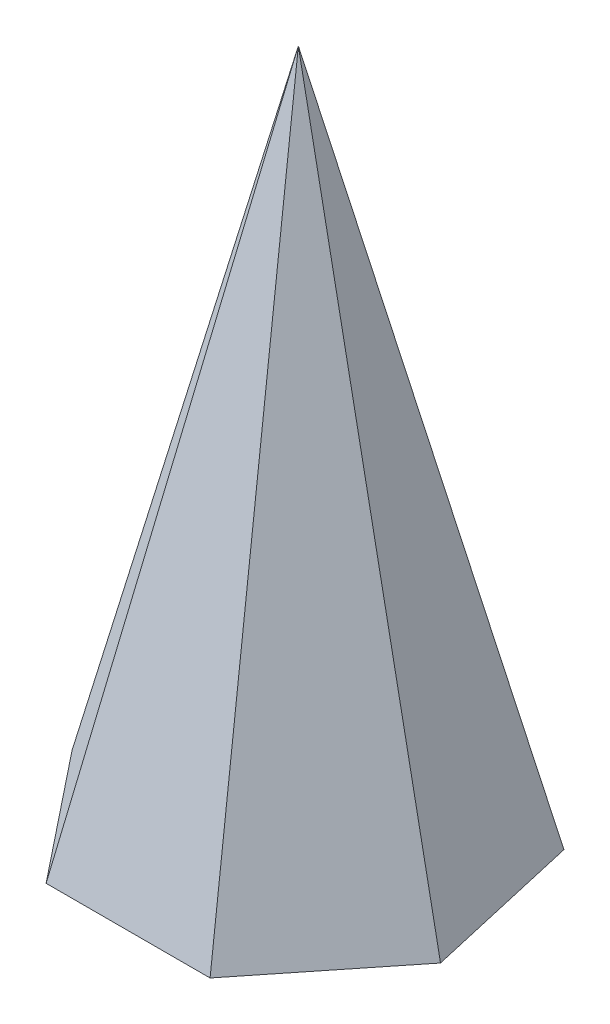
ISO-10303-21;
HEADER;
FILE_DESCRIPTION(('STEP AP214'),'2;1');
FILE_NAME('part.step','',(''),(''),'','','');
FILE_SCHEMA(('AUTOMOTIVE_DESIGN { 1 0 10303 214 1 1 1 1 }'));
ENDSEC;
DATA;
#1=APPLICATION_CONTEXT('core data for automotive mechanical design processes');
#2=APPLICATION_PROTOCOL_DEFINITION('international standard','automotive_design',2000,#1);
#3=PRODUCT_CONTEXT('',#1,'mechanical');
#4=PRODUCT('Part','Part','',(#3));
#5=PRODUCT_RELATED_PRODUCT_CATEGORY('part','',(#4));
#6=PRODUCT_DEFINITION_FORMATION('','',#4);
#7=PRODUCT_DEFINITION_CONTEXT('part definition',#1,'design');
#8=PRODUCT_DEFINITION('design','',#6,#7);
#9=PRODUCT_DEFINITION_SHAPE('','',#8);
#10=(LENGTH_UNIT() NAMED_UNIT(*) SI_UNIT(.MILLI.,.METRE.));
#11=(NAMED_UNIT(*) PLANE_ANGLE_UNIT() SI_UNIT($,.RADIAN.));
#12=(NAMED_UNIT(*) SI_UNIT($,.STERADIAN.) SOLID_ANGLE_UNIT());
#13=UNCERTAINTY_MEASURE_WITH_UNIT(LENGTH_MEASURE(1.E-05),#10,'distance_accuracy_value','');
#14=(GEOMETRIC_REPRESENTATION_CONTEXT(3) GLOBAL_UNCERTAINTY_ASSIGNED_CONTEXT((#13)) GLOBAL_UNIT_ASSIGNED_CONTEXT((#10,
#11,#12)) REPRESENTATION_CONTEXT('',''));
#15=CARTESIAN_POINT('',(0.,0.,0.));
#16=DIRECTION('',(0.,0.,1.));
#17=DIRECTION('',(1.,0.,0.));
#18=AXIS2_PLACEMENT_3D('',#15,#16,#17);
#19=CARTESIAN_POINT('',(0.,0.,8.01937735804838));
#20=DIRECTION('',(0.,-1.,0.));
#21=DIRECTION('',(0.,0.,-1.));
#22=AXIS2_PLACEMENT_3D('',#19,#20,#21);
#23=PLANE('',#22);
#24=DIRECTION('',(0.623489801858734,0.,-0.78183148246803));
#25=VECTOR('',#24,1.);
#26=CARTESIAN_POINT('',(2.40787309403764,0.,5.));
#27=LINE('',#26,#25);
#28=CARTESIAN_POINT('',(2.40787309403764,0.,5.));
#29=VERTEX_POINT('',#28);
#30=CARTESIAN_POINT('',(5.41044173064266,0.,1.23489801858734));
#31=VERTEX_POINT('',#30);
#32=EDGE_CURVE('E82',#29,#31,#27,.T.);
#33=ORIENTED_EDGE('',*,*,#32,.F.);
#34=DIRECTION('',(1.,0.,0.));
#35=VECTOR('',#34,1.);
#36=CARTESIAN_POINT('',(-2.40787309403764,0.,5.));
#37=LINE('',#36,#35);
#38=CARTESIAN_POINT('',(-2.40787309403764,0.,5.));
#39=VERTEX_POINT('',#38);
#40=EDGE_CURVE('E12',#39,#29,#37,.T.);
#41=ORIENTED_EDGE('',*,*,#40,.F.);
#42=DIRECTION('',(0.623489801858734,0.,0.78183148246803));
#43=VECTOR('',#42,1.);
#44=CARTESIAN_POINT('',(-5.41044173064266,0.,1.23489801858734));
#45=LINE('',#44,#43);
#46=CARTESIAN_POINT('',(-5.41044173064266,0.,1.23489801858734));
#47=VERTEX_POINT('',#46);
#48=EDGE_CURVE('E47',#47,#39,#45,.T.);
#49=ORIENTED_EDGE('',*,*,#48,.F.);
#50=DIRECTION('',(-0.222520933956314,0.,0.974927912181824));
#51=VECTOR('',#50,1.);
#52=CARTESIAN_POINT('',(-4.33883739117558,0.,-3.46010735815048));
#53=LINE('',#52,#51);
#54=CARTESIAN_POINT('',(-4.33883739117558,0.,-3.46010735815048));
#55=VERTEX_POINT('',#54);
#56=EDGE_CURVE('E118',#55,#47,#53,.T.);
#57=ORIENTED_EDGE('',*,*,#56,.F.);
#58=DIRECTION('',(-0.900968867902419,0.,0.433883739117558));
#59=VECTOR('',#58,1.);
#60=CARTESIAN_POINT('',(0.,0.,-5.54958132087371));
#61=LINE('',#60,#59);
#62=CARTESIAN_POINT('',(0.,0.,-5.54958132087371));
#63=VERTEX_POINT('',#62);
#64=EDGE_CURVE('E109',#63,#55,#61,.T.);
#65=ORIENTED_EDGE('',*,*,#64,.F.);
#66=DIRECTION('',(-0.900968867902419,0.,-0.433883739117558));
#67=VECTOR('',#66,1.);
#68=CARTESIAN_POINT('',(4.33883739117558,0.,-3.46010735815048));
#69=LINE('',#68,#67);
#70=CARTESIAN_POINT('',(4.33883739117558,0.,-3.46010735815048));
#71=VERTEX_POINT('',#70);
#72=EDGE_CURVE('E100',#71,#63,#69,.T.);
#73=ORIENTED_EDGE('',*,*,#72,.F.);
#74=DIRECTION('',(-0.222520933956314,0.,-0.974927912181824));
#75=VECTOR('',#74,1.);
#76=CARTESIAN_POINT('',(5.41044173064266,0.,1.23489801858734));
#77=LINE('',#76,#75);
#78=EDGE_CURVE('E91',#31,#71,#77,.T.);
#79=ORIENTED_EDGE('',*,*,#78,.F.);
#80=EDGE_LOOP('',(#33,#41,#49,#57,#65,#73,#79));
#81=FACE_BOUND('',#80,.T.);
#82=ADVANCED_FACE('F37',(#81),#23,.T.);
#83=CARTESIAN_POINT('',(-5.41044173064265,0.,1.23489801858734));
#84=DIRECTION('',(-0.758487949093865,0.242535625036333,0.604873955190349));
#85=DIRECTION('',(0.623489801858734,0.,0.78183148246803));
#86=AXIS2_PLACEMENT_3D('',#83,#84,#85);
#87=PLANE('',#86);
#88=DIRECTION('',(-0.260672945374847,-0.963592099693066,0.0594968987318689));
#89=VECTOR('',#88,1.);
#90=CARTESIAN_POINT('',(0.,20.,0.));
#91=LINE('',#90,#89);
#92=CARTESIAN_POINT('',(0.,20.,0.));
#93=VERTEX_POINT('',#92);
#94=EDGE_CURVE('E113',#93,#47,#91,.T.);
#95=ORIENTED_EDGE('',*,*,#94,.T.);
#96=ORIENTED_EDGE('',*,*,#48,.T.);
#97=DIRECTION('',(-0.116010374523909,-0.963592099693066,0.240898024923267));
#98=VECTOR('',#97,1.);
#99=CARTESIAN_POINT('',(0.,20.,0.));
#100=LINE('',#99,#98);
#101=EDGE_CURVE('E121',#93,#39,#100,.T.);
#102=ORIENTED_EDGE('',*,*,#101,.F.);
#103=EDGE_LOOP('',(#95,#96,#102));
#104=FACE_BOUND('',#103,.T.);
#105=ADVANCED_FACE('F124',(#104),#87,.T.);
#106=CARTESIAN_POINT('',(-2.40787309403764,0.,5.));
#107=DIRECTION('',(0.,0.242535625036333,0.970142500145332));
#108=DIRECTION('',(0.,-0.970142500145332,0.242535625036333));
#109=AXIS2_PLACEMENT_3D('',#106,#107,#108);
#110=PLANE('',#109);
#111=ORIENTED_EDGE('',*,*,#101,.T.);
#112=ORIENTED_EDGE('',*,*,#40,.T.);
#113=DIRECTION('',(0.116010374523909,-0.963592099693066,0.240898024923267));
#114=VECTOR('',#113,1.);
#115=CARTESIAN_POINT('',(0.,20.,0.));
#116=LINE('',#115,#114);
#117=EDGE_CURVE('E55',#93,#29,#116,.T.);
#118=ORIENTED_EDGE('',*,*,#117,.F.);
#119=EDGE_LOOP('',(#111,#112,#118));
#120=FACE_BOUND('',#119,.T.);
#121=ADVANCED_FACE('F128',(#120),#110,.T.);
#122=CARTESIAN_POINT('',(-4.33883739117558,0.,-3.46010735815048));
#123=DIRECTION('',(-0.945819002185543,0.242535625036333,-0.215877015203053));
#124=DIRECTION('',(-0.248392582482407,-0.968659447364098,0.));
#125=AXIS2_PLACEMENT_3D('',#122,#123,#124);
#126=PLANE('',#125);
#127=DIRECTION('',(-0.209043471599483,-0.963592099693066,-0.166706605720182));
#128=VECTOR('',#127,1.);
#129=CARTESIAN_POINT('',(0.,20.,0.));
#130=LINE('',#129,#128);
#131=EDGE_CURVE('E104',#93,#55,#130,.T.);
#132=ORIENTED_EDGE('',*,*,#131,.T.);
#133=ORIENTED_EDGE('',*,*,#56,.T.);
#134=ORIENTED_EDGE('',*,*,#94,.F.);
#135=EDGE_LOOP('',(#132,#133,#134));
#136=FACE_BOUND('',#135,.T.);
#137=ADVANCED_FACE('F117',(#136),#126,.T.);
#138=CARTESIAN_POINT('',(0.,0.,-5.54958132087371));
#139=DIRECTION('',(-0.420929055439913,0.242535625036333,-0.874068190059962));
#140=DIRECTION('',(-0.900968867902419,0.,0.433883739117558));
#141=AXIS2_PLACEMENT_3D('',#138,#139,#140);
#142=PLANE('',#141);
#143=DIRECTION('',(0.,-0.963592099693066,-0.267376635869906));
#144=VECTOR('',#143,1.);
#145=CARTESIAN_POINT('',(0.,20.,0.));
#146=LINE('',#145,#144);
#147=EDGE_CURVE('E95',#93,#63,#146,.T.);
#148=ORIENTED_EDGE('',*,*,#147,.T.);
#149=ORIENTED_EDGE('',*,*,#64,.T.);
#150=ORIENTED_EDGE('',*,*,#131,.F.);
#151=EDGE_LOOP('',(#148,#149,#150));
#152=FACE_BOUND('',#151,.T.);
#153=ADVANCED_FACE('F108',(#152),#142,.T.);
#154=CARTESIAN_POINT('',(4.33883739117558,0.,-3.46010735815048));
#155=DIRECTION('',(0.420929055439913,0.242535625036333,-0.874068190059962));
#156=DIRECTION('',(-0.900968867902419,0.,-0.433883739117558));
#157=AXIS2_PLACEMENT_3D('',#154,#155,#156);
#158=PLANE('',#157);
#159=DIRECTION('',(0.209043471599483,-0.963592099693066,-0.166706605720182));
#160=VECTOR('',#159,1.);
#161=CARTESIAN_POINT('',(0.,20.,0.));
#162=LINE('',#161,#160);
#163=EDGE_CURVE('E86',#93,#71,#162,.T.);
#164=ORIENTED_EDGE('',*,*,#163,.T.);
#165=ORIENTED_EDGE('',*,*,#72,.T.);
#166=ORIENTED_EDGE('',*,*,#147,.F.);
#167=EDGE_LOOP('',(#164,#165,#166));
#168=FACE_BOUND('',#167,.T.);
#169=ADVANCED_FACE('F99',(#168),#158,.T.);
#170=CARTESIAN_POINT('',(5.41044173064266,0.,1.23489801858733));
#171=DIRECTION('',(0.945819002185543,0.242535625036333,-0.215877015203053));
#172=DIRECTION('',(-0.248392582482407,0.968659447364098,0.));
#173=AXIS2_PLACEMENT_3D('',#170,#171,#172);
#174=PLANE('',#173);
#175=DIRECTION('',(0.260672945374847,-0.963592099693066,0.0594968987318689));
#176=VECTOR('',#175,1.);
#177=CARTESIAN_POINT('',(0.,20.,0.));
#178=LINE('',#177,#176);
#179=EDGE_CURVE('E79',#93,#31,#178,.T.);
#180=ORIENTED_EDGE('',*,*,#179,.T.);
#181=ORIENTED_EDGE('',*,*,#78,.T.);
#182=ORIENTED_EDGE('',*,*,#163,.F.);
#183=EDGE_LOOP('',(#180,#181,#182));
#184=FACE_BOUND('',#183,.T.);
#185=ADVANCED_FACE('F90',(#184),#174,.T.);
#186=CARTESIAN_POINT('',(2.40787309403764,0.,5.));
#187=DIRECTION('',(0.758487949093866,0.242535625036333,0.604873955190349));
#188=DIRECTION('',(0.623489801858734,0.,-0.78183148246803));
#189=AXIS2_PLACEMENT_3D('',#186,#187,#188);
#190=PLANE('',#189);
#191=ORIENTED_EDGE('',*,*,#117,.T.);
#192=ORIENTED_EDGE('',*,*,#32,.T.);
#193=ORIENTED_EDGE('',*,*,#179,.F.);
#194=EDGE_LOOP('',(#191,#192,#193));
#195=FACE_BOUND('',#194,.T.);
#196=ADVANCED_FACE('F81',(#195),#190,.T.);
#197=CLOSED_SHELL('',(#82,#105,#121,#137,#153,#169,#185,#196));
#198=MANIFOLD_SOLID_BREP('B2',#197);
#199=ADVANCED_BREP_SHAPE_REPRESENTATION('',(#18,#198),#14);
#200=SHAPE_DEFINITION_REPRESENTATION(#9,#199);
ENDSEC;
END-ISO-10303-21;
